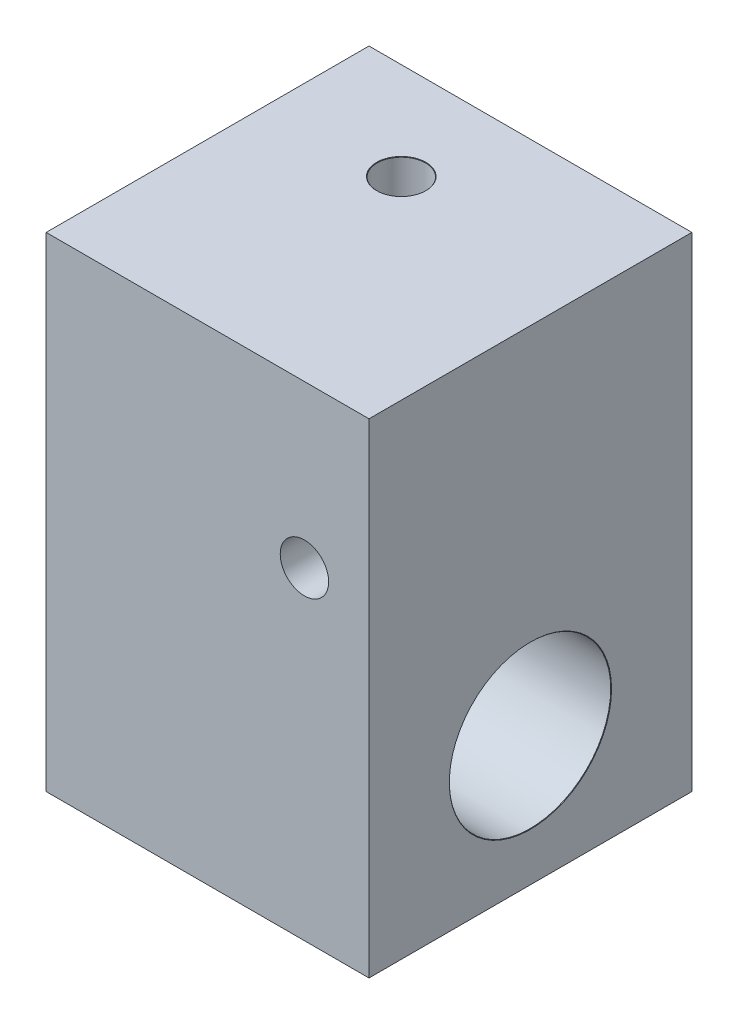
ISO-10303-21;
HEADER;
FILE_DESCRIPTION(('STEP AP214'),'2;1');
FILE_NAME('part.step','',(''),(''),'','','');
FILE_SCHEMA(('AUTOMOTIVE_DESIGN { 1 0 10303 214 1 1 1 1 }'));
ENDSEC;
DATA;
#1=APPLICATION_CONTEXT('core data for automotive mechanical design processes');
#2=APPLICATION_PROTOCOL_DEFINITION('international standard','automotive_design',2000,#1);
#3=PRODUCT_CONTEXT('',#1,'mechanical');
#4=PRODUCT('Part','Part','',(#3));
#5=PRODUCT_RELATED_PRODUCT_CATEGORY('part','',(#4));
#6=PRODUCT_DEFINITION_FORMATION('','',#4);
#7=PRODUCT_DEFINITION_CONTEXT('part definition',#1,'design');
#8=PRODUCT_DEFINITION('design','',#6,#7);
#9=PRODUCT_DEFINITION_SHAPE('','',#8);
#10=(LENGTH_UNIT() NAMED_UNIT(*) SI_UNIT(.MILLI.,.METRE.));
#11=(NAMED_UNIT(*) PLANE_ANGLE_UNIT() SI_UNIT($,.RADIAN.));
#12=(NAMED_UNIT(*) SI_UNIT($,.STERADIAN.) SOLID_ANGLE_UNIT());
#13=UNCERTAINTY_MEASURE_WITH_UNIT(LENGTH_MEASURE(1.E-05),#10,'distance_accuracy_value','');
#14=(GEOMETRIC_REPRESENTATION_CONTEXT(3) GLOBAL_UNCERTAINTY_ASSIGNED_CONTEXT((#13)) GLOBAL_UNIT_ASSIGNED_CONTEXT((#10,
#11,#12)) REPRESENTATION_CONTEXT('',''));
#15=CARTESIAN_POINT('',(0.,0.,0.));
#16=DIRECTION('',(0.,0.,1.));
#17=DIRECTION('',(1.,0.,0.));
#18=AXIS2_PLACEMENT_3D('',#15,#16,#17);
#19=CARTESIAN_POINT('',(0.,30.,-1.9004617207274));
#20=DIRECTION('',(1.,0.,0.));
#21=DIRECTION('',(0.,0.,-1.));
#22=AXIS2_PLACEMENT_3D('',#19,#20,#21);
#23=PLANE('',#22);
#24=CARTESIAN_POINT('',(0.,8.,8.0995382792726));
#25=DIRECTION('',(1.,0.,0.));
#26=DIRECTION('',(0.,0.,-1.));
#27=AXIS2_PLACEMENT_3D('',#24,#25,#26);
#28=CIRCLE('',#27,0.00716155294845132);
#29=CARTESIAN_POINT('',(0.,8.,8.09237672632415));
#30=VERTEX_POINT('',#29);
#31=EDGE_CURVE('E40',#30,#30,#28,.T.);
#32=ORIENTED_EDGE('',*,*,#31,.T.);
#33=EDGE_LOOP('',(#32));
#34=FACE_BOUND('',#33,.T.);
#35=CARTESIAN_POINT('',(0.,25.,8.0995382792726));
#36=DIRECTION('',(-1.,0.,0.));
#37=DIRECTION('',(0.,0.,1.));
#38=AXIS2_PLACEMENT_3D('',#35,#36,#37);
#39=CIRCLE('',#38,1.525);
#40=CARTESIAN_POINT('',(0.,25.,9.6245382792726));
#41=VERTEX_POINT('',#40);
#42=EDGE_CURVE('E104',#41,#41,#39,.T.);
#43=ORIENTED_EDGE('',*,*,#42,.F.);
#44=EDGE_LOOP('',(#43));
#45=FACE_BOUND('',#44,.T.);
#46=DIRECTION('',(0.,0.,1.));
#47=VECTOR('',#46,1.);
#48=CARTESIAN_POINT('',(0.,0.,-1.9004617207274));
#49=LINE('',#48,#47);
#50=CARTESIAN_POINT('',(0.,0.,-1.9004617207274));
#51=VERTEX_POINT('',#50);
#52=CARTESIAN_POINT('',(0.,0.,18.0995382792726));
#53=VERTEX_POINT('',#52);
#54=EDGE_CURVE('E129',#51,#53,#49,.T.);
#55=ORIENTED_EDGE('',*,*,#54,.T.);
#56=DIRECTION('',(0.,-1.,0.));
#57=VECTOR('',#56,1.);
#58=CARTESIAN_POINT('',(0.,30.,18.0995382792726));
#59=LINE('',#58,#57);
#60=CARTESIAN_POINT('',(0.,30.,18.0995382792726));
#61=VERTEX_POINT('',#60);
#62=EDGE_CURVE('E45',#61,#53,#59,.T.);
#63=ORIENTED_EDGE('',*,*,#62,.F.);
#64=DIRECTION('',(0.,0.,1.));
#65=VECTOR('',#64,1.);
#66=CARTESIAN_POINT('',(0.,30.,-1.9004617207274));
#67=LINE('',#66,#65);
#68=CARTESIAN_POINT('',(0.,30.,-1.9004617207274));
#69=VERTEX_POINT('',#68);
#70=EDGE_CURVE('E130',#69,#61,#67,.T.);
#71=ORIENTED_EDGE('',*,*,#70,.F.);
#72=DIRECTION('',(0.,-1.,0.));
#73=VECTOR('',#72,1.);
#74=CARTESIAN_POINT('',(0.,30.,-1.9004617207274));
#75=LINE('',#74,#73);
#76=EDGE_CURVE('E136',#69,#51,#75,.T.);
#77=ORIENTED_EDGE('',*,*,#76,.T.);
#78=EDGE_LOOP('',(#55,#63,#71,#77));
#79=FACE_BOUND('',#78,.T.);
#80=ADVANCED_FACE('F37',(#34,#45,#79),#23,.F.);
#81=CARTESIAN_POINT('',(0.,30.,18.0995382792726));
#82=DIRECTION('',(0.,0.,-1.));
#83=DIRECTION('',(-1.,0.,0.));
#84=AXIS2_PLACEMENT_3D('',#81,#82,#83);
#85=PLANE('',#84);
#86=CARTESIAN_POINT('',(16.,20.,18.0995382792726));
#87=DIRECTION('',(0.,0.,-1.));
#88=DIRECTION('',(-1.,0.,0.));
#89=AXIS2_PLACEMENT_3D('',#86,#87,#88);
#90=CIRCLE('',#89,1.5);
#91=CARTESIAN_POINT('',(14.5,20.,18.0995382792726));
#92=VERTEX_POINT('',#91);
#93=EDGE_CURVE('E126',#92,#92,#90,.T.);
#94=ORIENTED_EDGE('',*,*,#93,.T.);
#95=EDGE_LOOP('',(#94));
#96=FACE_BOUND('',#95,.T.);
#97=DIRECTION('',(1.,0.,0.));
#98=VECTOR('',#97,1.);
#99=CARTESIAN_POINT('',(0.,0.,18.0995382792726));
#100=LINE('',#99,#98);
#101=CARTESIAN_POINT('',(20.,0.,18.0995382792726));
#102=VERTEX_POINT('',#101);
#103=EDGE_CURVE('E139',#53,#102,#100,.T.);
#104=ORIENTED_EDGE('',*,*,#103,.T.);
#105=DIRECTION('',(0.,-1.,0.));
#106=VECTOR('',#105,1.);
#107=CARTESIAN_POINT('',(20.,30.,18.0995382792726));
#108=LINE('',#107,#106);
#109=CARTESIAN_POINT('',(20.,30.,18.0995382792726));
#110=VERTEX_POINT('',#109);
#111=EDGE_CURVE('E147',#110,#102,#108,.T.);
#112=ORIENTED_EDGE('',*,*,#111,.F.);
#113=DIRECTION('',(1.,0.,0.));
#114=VECTOR('',#113,1.);
#115=CARTESIAN_POINT('',(0.,30.,18.0995382792726));
#116=LINE('',#115,#114);
#117=EDGE_CURVE('E88',#61,#110,#116,.T.);
#118=ORIENTED_EDGE('',*,*,#117,.F.);
#119=ORIENTED_EDGE('',*,*,#62,.T.);
#120=EDGE_LOOP('',(#104,#112,#118,#119));
#121=FACE_BOUND('',#120,.T.);
#122=ADVANCED_FACE('F186',(#96,#121),#85,.F.);
#123=CARTESIAN_POINT('',(20.,30.,-1.9004617207274));
#124=DIRECTION('',(-1.,0.,0.));
#125=DIRECTION('',(0.,0.,1.));
#126=AXIS2_PLACEMENT_3D('',#123,#124,#125);
#127=PLANE('',#126);
#128=CARTESIAN_POINT('',(20.,8.,8.0995382792726));
#129=DIRECTION('',(1.,0.,0.));
#130=DIRECTION('',(0.,0.,-1.));
#131=AXIS2_PLACEMENT_3D('',#128,#129,#130);
#132=CIRCLE('',#131,5.025);
#133=CARTESIAN_POINT('',(20.,8.,3.07453827927259));
#134=VERTEX_POINT('',#133);
#135=EDGE_CURVE('E230',#134,#134,#132,.T.);
#136=ORIENTED_EDGE('',*,*,#135,.F.);
#137=EDGE_LOOP('',(#136));
#138=FACE_BOUND('',#137,.T.);
#139=DIRECTION('',(0.,0.,-1.));
#140=VECTOR('',#139,1.);
#141=CARTESIAN_POINT('',(20.,0.,-1.9004617207274));
#142=LINE('',#141,#140);
#143=CARTESIAN_POINT('',(20.,0.,-1.9004617207274));
#144=VERTEX_POINT('',#143);
#145=EDGE_CURVE('E141',#102,#144,#142,.T.);
#146=ORIENTED_EDGE('',*,*,#145,.T.);
#147=DIRECTION('',(0.,-1.,0.));
#148=VECTOR('',#147,1.);
#149=CARTESIAN_POINT('',(20.,30.,-1.9004617207274));
#150=LINE('',#149,#148);
#151=CARTESIAN_POINT('',(20.,30.,-1.9004617207274));
#152=VERTEX_POINT('',#151);
#153=EDGE_CURVE('E145',#152,#144,#150,.T.);
#154=ORIENTED_EDGE('',*,*,#153,.F.);
#155=DIRECTION('',(0.,0.,-1.));
#156=VECTOR('',#155,1.);
#157=CARTESIAN_POINT('',(20.,30.,-1.9004617207274));
#158=LINE('',#157,#156);
#159=EDGE_CURVE('E133',#110,#152,#158,.T.);
#160=ORIENTED_EDGE('',*,*,#159,.F.);
#161=ORIENTED_EDGE('',*,*,#111,.T.);
#162=EDGE_LOOP('',(#146,#154,#160,#161));
#163=FACE_BOUND('',#162,.T.);
#164=ADVANCED_FACE('F191',(#138,#163),#127,.F.);
#165=CARTESIAN_POINT('',(0.,30.,-1.9004617207274));
#166=DIRECTION('',(0.,0.,1.));
#167=DIRECTION('',(1.,0.,0.));
#168=AXIS2_PLACEMENT_3D('',#165,#166,#167);
#169=PLANE('',#168);
#170=CARTESIAN_POINT('',(16.,20.,-1.90046172072741));
#171=DIRECTION('',(0.,0.,-1.));
#172=DIRECTION('',(-1.,0.,0.));
#173=AXIS2_PLACEMENT_3D('',#170,#171,#172);
#174=CIRCLE('',#173,1.525);
#175=CARTESIAN_POINT('',(14.475,20.,-1.90046172072741));
#176=VERTEX_POINT('',#175);
#177=EDGE_CURVE('E120',#176,#176,#174,.T.);
#178=ORIENTED_EDGE('',*,*,#177,.F.);
#179=EDGE_LOOP('',(#178));
#180=FACE_BOUND('',#179,.T.);
#181=DIRECTION('',(-1.,0.,0.));
#182=VECTOR('',#181,1.);
#183=CARTESIAN_POINT('',(0.,0.,-1.9004617207274));
#184=LINE('',#183,#182);
#185=EDGE_CURVE('E80',#144,#51,#184,.T.);
#186=ORIENTED_EDGE('',*,*,#185,.T.);
#187=ORIENTED_EDGE('',*,*,#76,.F.);
#188=DIRECTION('',(-1.,0.,0.));
#189=VECTOR('',#188,1.);
#190=CARTESIAN_POINT('',(0.,30.,-1.9004617207274));
#191=LINE('',#190,#189);
#192=EDGE_CURVE('E59',#152,#69,#191,.T.);
#193=ORIENTED_EDGE('',*,*,#192,.F.);
#194=ORIENTED_EDGE('',*,*,#153,.T.);
#195=EDGE_LOOP('',(#186,#187,#193,#194));
#196=FACE_BOUND('',#195,.T.);
#197=ADVANCED_FACE('F209',(#180,#196),#169,.F.);
#198=CARTESIAN_POINT('',(0.,30.,0.));
#199=DIRECTION('',(0.,1.,0.));
#200=DIRECTION('',(0.,0.,1.));
#201=AXIS2_PLACEMENT_3D('',#198,#199,#200);
#202=PLANE('',#201);
#203=CARTESIAN_POINT('',(8.,30.,4.0995382792726));
#204=DIRECTION('',(0.,1.,0.));
#205=DIRECTION('',(0.,0.,1.));
#206=AXIS2_PLACEMENT_3D('',#203,#204,#205);
#207=CIRCLE('',#206,1.525);
#208=CARTESIAN_POINT('',(8.,30.,5.6245382792726));
#209=VERTEX_POINT('',#208);
#210=EDGE_CURVE('E111',#209,#209,#207,.T.);
#211=ORIENTED_EDGE('',*,*,#210,.F.);
#212=EDGE_LOOP('',(#211));
#213=FACE_BOUND('',#212,.T.);
#214=ORIENTED_EDGE('',*,*,#70,.T.);
#215=ORIENTED_EDGE('',*,*,#117,.T.);
#216=ORIENTED_EDGE('',*,*,#159,.T.);
#217=ORIENTED_EDGE('',*,*,#192,.T.);
#218=EDGE_LOOP('',(#214,#215,#216,#217));
#219=FACE_BOUND('',#218,.T.);
#220=ADVANCED_FACE('F207',(#213,#219),#202,.T.);
#221=CARTESIAN_POINT('',(0.,0.,0.));
#222=DIRECTION('',(0.,1.,0.));
#223=DIRECTION('',(0.,0.,1.));
#224=AXIS2_PLACEMENT_3D('',#221,#222,#223);
#225=PLANE('',#224);
#226=ORIENTED_EDGE('',*,*,#54,.F.);
#227=ORIENTED_EDGE('',*,*,#185,.F.);
#228=ORIENTED_EDGE('',*,*,#145,.F.);
#229=ORIENTED_EDGE('',*,*,#103,.F.);
#230=EDGE_LOOP('',(#226,#227,#228,#229));
#231=FACE_BOUND('',#230,.T.);
#232=ADVANCED_FACE('F202',(#231),#225,.F.);
#233=CARTESIAN_POINT('',(16.,20.,-1.9004617207274));
#234=DIRECTION('',(0.,0.,-1.));
#235=DIRECTION('',(-1.,0.,0.));
#236=AXIS2_PLACEMENT_3D('',#233,#234,#235);
#237=CYLINDRICAL_SURFACE('',#236,1.5);
#238=ORIENTED_EDGE('',*,*,#93,.F.);
#239=EDGE_LOOP('',(#238));
#240=FACE_BOUND('',#239,.T.);
#241=CARTESIAN_POINT('',(16.,20.,-1.8754617207274));
#242=DIRECTION('',(0.,0.,-1.));
#243=DIRECTION('',(-1.,0.,0.));
#244=AXIS2_PLACEMENT_3D('',#241,#242,#243);
#245=CIRCLE('',#244,1.5);
#246=CARTESIAN_POINT('',(14.5,20.,-1.8754617207274));
#247=VERTEX_POINT('',#246);
#248=EDGE_CURVE('E123',#247,#247,#245,.T.);
#249=ORIENTED_EDGE('',*,*,#248,.T.);
#250=EDGE_LOOP('',(#249));
#251=FACE_BOUND('',#250,.T.);
#252=ADVANCED_FACE('F216',(#240,#251),#237,.F.);
#253=CARTESIAN_POINT('',(16.,20.,-1.90046172072741));
#254=DIRECTION('',(0.,0.,-1.));
#255=DIRECTION('',(-1.,0.,0.));
#256=AXIS2_PLACEMENT_3D('',#253,#254,#255);
#257=CONICAL_SURFACE('',#256,1.525,0.785398163397357);
#258=ORIENTED_EDGE('',*,*,#248,.F.);
#259=EDGE_LOOP('',(#258));
#260=FACE_BOUND('',#259,.T.);
#261=ORIENTED_EDGE('',*,*,#177,.T.);
#262=EDGE_LOOP('',(#261));
#263=FACE_BOUND('',#262,.T.);
#264=ADVANCED_FACE('F314',(#260,#263),#257,.F.);
#265=CARTESIAN_POINT('',(12.,25.,8.0995382792726));
#266=DIRECTION('',(-1.,0.,0.));
#267=DIRECTION('',(0.,0.,1.));
#268=AXIS2_PLACEMENT_3D('',#265,#266,#267);
#269=CONICAL_SURFACE('',#268,1.5,1.02974425867665);
#270=CARTESIAN_POINT('',(12.9012909285413,25.,8.0995382792726));
#271=VERTEX_POINT('',#270);
#272=VERTEX_LOOP('',#271);
#273=FACE_BOUND('',#272,.T.);
#274=CARTESIAN_POINT('',(12.,25.,8.0995382792726));
#275=DIRECTION('',(-1.,0.,0.));
#276=DIRECTION('',(0.,0.,1.));
#277=AXIS2_PLACEMENT_3D('',#274,#275,#276);
#278=CIRCLE('',#277,1.5);
#279=CARTESIAN_POINT('',(12.,25.,9.59953827927259));
#280=VERTEX_POINT('',#279);
#281=EDGE_CURVE('E117',#280,#280,#278,.T.);
#282=ORIENTED_EDGE('',*,*,#281,.T.);
#283=EDGE_LOOP('',(#282));
#284=FACE_BOUND('',#283,.T.);
#285=ADVANCED_FACE('F304',(#273,#284),#269,.F.);
#286=CARTESIAN_POINT('',(0.,25.,8.0995382792726));
#287=DIRECTION('',(-1.,0.,0.));
#288=DIRECTION('',(0.,0.,1.));
#289=AXIS2_PLACEMENT_3D('',#286,#287,#288);
#290=CYLINDRICAL_SURFACE('',#289,1.49999999999999);
#291=ORIENTED_EDGE('',*,*,#281,.F.);
#292=EDGE_LOOP('',(#291));
#293=FACE_BOUND('',#292,.T.);
#294=CARTESIAN_POINT('',(0.0250000000000121,25.,8.0995382792726));
#295=DIRECTION('',(-1.,0.,0.));
#296=DIRECTION('',(0.,0.,1.));
#297=AXIS2_PLACEMENT_3D('',#294,#295,#296);
#298=CIRCLE('',#297,1.49999999999999);
#299=CARTESIAN_POINT('',(0.0250000000000123,25.,9.59953827927258));
#300=VERTEX_POINT('',#299);
#301=EDGE_CURVE('E108',#300,#300,#298,.T.);
#302=ORIENTED_EDGE('',*,*,#301,.T.);
#303=EDGE_LOOP('',(#302));
#304=FACE_BOUND('',#303,.T.);
#305=ADVANCED_FACE('F295',(#293,#304),#290,.F.);
#306=CARTESIAN_POINT('',(0.,25.,8.0995382792726));
#307=DIRECTION('',(-1.,0.,0.));
#308=DIRECTION('',(0.,0.,1.));
#309=AXIS2_PLACEMENT_3D('',#306,#307,#308);
#310=CONICAL_SURFACE('',#309,1.525,0.785398163397414);
#311=ORIENTED_EDGE('',*,*,#301,.F.);
#312=EDGE_LOOP('',(#311));
#313=FACE_BOUND('',#312,.T.);
#314=ORIENTED_EDGE('',*,*,#42,.T.);
#315=EDGE_LOOP('',(#314));
#316=FACE_BOUND('',#315,.T.);
#317=ADVANCED_FACE('F268',(#313,#316),#310,.F.);
#318=CARTESIAN_POINT('',(8.,10.,4.0995382792726));
#319=DIRECTION('',(0.,1.,0.));
#320=DIRECTION('',(0.,0.,1.));
#321=AXIS2_PLACEMENT_3D('',#318,#319,#320);
#322=CONICAL_SURFACE('',#321,1.49999999999999,1.02974425867665);
#323=CARTESIAN_POINT('',(8.,10.,4.0995382792726));
#324=DIRECTION('',(0.,1.,0.));
#325=DIRECTION('',(0.,0.,1.));
#326=AXIS2_PLACEMENT_3D('',#323,#324,#325);
#327=CIRCLE('',#326,1.49999999999999);
#328=CARTESIAN_POINT('',(9.38224656253748,10.,3.51696258431676));
#329=VERTEX_POINT('',#328);
#330=CARTESIAN_POINT('',(6.61775343746252,10.,3.51696258431676));
#331=VERTEX_POINT('',#330);
#332=EDGE_CURVE('E100',#329,#331,#327,.T.);
#333=ORIENTED_EDGE('',*,*,#332,.T.);
#334=CARTESIAN_POINT('',(6.44123645028541,10.0903290928541,3.55745458524322));
#335=CARTESIAN_POINT('',(6.47638702361608,10.0720429405464,3.54903882483175));
#336=CARTESIAN_POINT('',(6.51163876865664,10.0538669079315,3.54080807996175));
#337=CARTESIAN_POINT('',(6.58236772703157,10.0177858987624,3.52472352478772));
#338=CARTESIAN_POINT('',(6.61784494798864,9.99988093144204,3.51686972730482));
#339=CARTESIAN_POINT('',(6.72478174543633,9.94658301792164,3.49385572054587));
#340=CARTESIAN_POINT('',(6.79661251243338,9.91167722384374,3.47927506399216));
#341=CARTESIAN_POINT('',(6.94495589717175,9.84219689922331,3.45112133170947));
#342=CARTESIAN_POINT('',(7.02152861602041,9.80771723126283,3.43762925721693));
#343=CARTESIAN_POINT('',(7.17642553254067,9.74215666224481,3.41273640883918));
#344=CARTESIAN_POINT('',(7.25474836588889,9.71107321780461,3.40133406558906));
#345=CARTESIAN_POINT('',(7.38116547775162,9.6661010776519,3.38525934407128));
#346=CARTESIAN_POINT('',(7.42849634106478,9.65038548044021,3.37974372502932));
#347=CARTESIAN_POINT('',(7.52405997696393,9.62160673917025,3.36977903888754));
#348=CARTESIAN_POINT('',(7.5722923071465,9.60854232950347,3.36532946270227));
#349=CARTESIAN_POINT('',(7.66883665700479,9.58609091994483,3.35776068805869));
#350=CARTESIAN_POINT('',(7.71713259177767,9.57664371377543,3.3546196244471));
#351=CARTESIAN_POINT('',(7.81443289620939,9.56194994906261,3.34976210905704));
#352=CARTESIAN_POINT('',(7.86343697813677,9.55670173069128,3.34804509435304));
#353=CARTESIAN_POINT('',(7.96239580021981,9.55096468892006,3.3461690529115));
#354=CARTESIAN_POINT('',(8.01235467476216,9.5505377293244,3.346030277128));
#355=CARTESIAN_POINT('',(8.11204309695725,9.55466018728013,3.34737713619428));
#356=CARTESIAN_POINT('',(8.16177260777769,9.55921037793576,3.34886302340409));
#357=CARTESIAN_POINT('',(8.26145363040456,9.57286406381851,3.35336618209512));
#358=CARTESIAN_POINT('',(8.31139207697459,9.58205064948085,3.35641141422722));
#359=CARTESIAN_POINT('',(8.41033640760895,9.60411631276034,3.36382871212606));
#360=CARTESIAN_POINT('',(8.45934200985356,9.61699648793708,3.36820117230464));
#361=CARTESIAN_POINT('',(8.55538706879129,9.64525946409422,3.37795593177209));
#362=CARTESIAN_POINT('',(8.60244621647877,9.6605845135811,3.38331528591629));
#363=CARTESIAN_POINT('',(8.69575461266634,9.69324476912792,3.39494235146468));
#364=CARTESIAN_POINT('',(8.74200360191829,9.7105806055808,3.40121034788799));
#365=CARTESIAN_POINT('',(8.83386441838471,9.74677429624331,3.41454605818499));
#366=CARTESIAN_POINT('',(8.87947513754158,9.76563448549195,3.42161500589463));
#367=CARTESIAN_POINT('',(8.97009828926242,9.80448379472837,3.43646291937563));
#368=CARTESIAN_POINT('',(9.01511065460828,9.82447304025043,3.44424196415871));
#369=CARTESIAN_POINT('',(9.14475071973116,9.88359569682011,3.46771405695268));
#370=CARTESIAN_POINT('',(9.22872441522546,9.92382943539441,3.48425104611692));
#371=CARTESIAN_POINT('',(9.35345321355006,9.98547610502822,3.5105967030124));
#372=CARTESIAN_POINT('',(9.39472989189421,10.0061914817338,3.51961260888526));
#373=CARTESIAN_POINT('',(9.47697073009595,10.0479980549236,3.53815402131795));
#374=CARTESIAN_POINT('',(9.51793492862447,10.0690892037901,3.5476794636115));
#375=CARTESIAN_POINT('',(9.55876354971459,10.0903290928541,3.55745458524315));
#376=B_SPLINE_CURVE_WITH_KNOTS('',3,(#334,#335,#336,#337,#338,#339,#340,#341,#342,#343,#344,
#345,#346,#347,#348,#349,#350,#351,#352,#353,#354,#355,#356,#357,#358,#359,#360,#361,#362,#363,
#364,#365,#366,#367,#368,#369,#370,#371,#372,#373,#374,#375),.UNSPECIFIED.,.F.,.F.,(4,2,2,2,2,2,
2,2,2,2,2,2,2,2,2,2,2,2,2,2,4),(0.,0.121517600913621,0.243039332084113,0.486546431611187,
0.741644887927715,0.996550976024085,1.14701268358301,1.29740239476079,1.4451671695246,
1.59287350509923,1.74247300742259,1.89209575044202,2.04450056026567,2.19695070458047,
2.34622364546585,2.49554351138879,2.64509660924532,2.79466636804234,3.0782968808009,
3.21945898738441,3.36060333141117),.UNSPECIFIED.);
#377=EDGE_CURVE('E11',#331,#329,#376,.T.);
#378=ORIENTED_EDGE('',*,*,#377,.T.);
#379=EDGE_LOOP('',(#333,#378));
#380=FACE_BOUND('',#379,.T.);
#381=ADVANCED_FACE('F103',(#380),#322,.F.);
#382=CARTESIAN_POINT('',(8.,30.,4.0995382792726));
#383=DIRECTION('',(0.,1.,0.));
#384=DIRECTION('',(0.,0.,1.));
#385=AXIS2_PLACEMENT_3D('',#382,#383,#384);
#386=CYLINDRICAL_SURFACE('',#385,1.49999999999999);
#387=ORIENTED_EDGE('',*,*,#332,.F.);
#388=CARTESIAN_POINT('',(9.38224656253749,10.,3.51696258431676));
#389=CARTESIAN_POINT('',(9.40272047788601,10.1114743482228,3.56560865951727));
#390=CARTESIAN_POINT('',(9.42199212450891,10.2214568986314,3.61845711603745));
#391=CARTESIAN_POINT('',(9.45569548491361,10.4384652182196,3.73273120455118));
#392=CARTESIAN_POINT('',(9.47009806174932,10.5454697890159,3.79420546171662));
#393=CARTESIAN_POINT('',(9.49149545281046,10.7568878254345,3.9263684416665));
#394=CARTESIAN_POINT('',(9.4983690439718,10.8612331941248,3.99718794714836));
#395=CARTESIAN_POINT('',(9.50111888288063,11.0641434611483,4.14646113903656));
#396=CARTESIAN_POINT('',(9.49702643349112,11.1627239939736,4.22489248086523));
#397=CARTESIAN_POINT('',(9.47559884495974,11.3417424534158,4.37865048725254));
#398=CARTESIAN_POINT('',(9.45985871135463,11.4229571546482,4.45327789158043));
#399=CARTESIAN_POINT('',(9.41436019424427,11.5780643718663,4.60537166200209));
#400=CARTESIAN_POINT('',(9.38465311000718,11.6519824951603,4.68282669010499));
#401=CARTESIAN_POINT('',(9.30805190980846,11.7919868504237,4.838876065046));
#402=CARTESIAN_POINT('',(9.26092834724774,11.8579521766289,4.91747150937529));
#403=CARTESIAN_POINT('',(9.17626493721971,11.948399306578,5.03155261860306));
#404=CARTESIAN_POINT('',(9.14571414891291,11.9771315230015,5.06894428749397));
#405=CARTESIAN_POINT('',(9.07991883205923,12.0315596771523,5.14173805640659));
#406=CARTESIAN_POINT('',(9.04467643056073,12.0572569809204,5.17714104775774));
#407=CARTESIAN_POINT('',(8.95409683218655,12.1153267164945,5.25919586691597));
#408=CARTESIAN_POINT('',(8.89645648308377,12.1460975376081,5.3044853763294));
#409=CARTESIAN_POINT('',(8.77288633768327,12.200702749519,5.3872392817129));
#410=CARTESIAN_POINT('',(8.70696015001725,12.2245401450593,5.42470706539609));
#411=CARTESIAN_POINT('',(8.56812378459614,12.2651294256811,5.48991014025968));
#412=CARTESIAN_POINT('',(8.49519083623824,12.2818571804065,5.51761223296058));
#413=CARTESIAN_POINT('',(8.34468517655983,12.3080188534151,5.56150048573387));
#414=CARTESIAN_POINT('',(8.26711299347749,12.3174536004064,5.5776879542023));
#415=CARTESIAN_POINT('',(8.11471729319815,12.3286705056178,5.59699424388842));
#416=CARTESIAN_POINT('',(8.04001910802131,12.3308885460719,5.60085715316018));
#417=CARTESIAN_POINT('',(7.89097435720005,12.3289071689672,5.5974256502569));
#418=CARTESIAN_POINT('',(7.81662772434895,12.3247090322327,5.59013346490852));
#419=CARTESIAN_POINT('',(7.67186477769903,12.3100342288961,5.56501515139864));
#420=CARTESIAN_POINT('',(7.60140052925537,12.2996789426034,5.54739276235658));
#421=CARTESIAN_POINT('',(7.46481078493203,12.2728064541796,5.50265533063686));
#422=CARTESIAN_POINT('',(7.39868514535618,12.2562894562476,5.47554060253728));
#423=CARTESIAN_POINT('',(7.27107348845815,12.2167716094418,5.41248743017811));
#424=CARTESIAN_POINT('',(7.20971137265014,12.1936439942567,5.37637844738413));
#425=CARTESIAN_POINT('',(7.09443499967231,12.1412781303886,5.29738606652725));
#426=CARTESIAN_POINT('',(7.04052213925085,12.1120387383124,5.25450140123444));
#427=CARTESIAN_POINT('',(6.93735988789654,12.0455598889783,5.16066660066704));
#428=CARTESIAN_POINT('',(6.88870500521939,12.0079024596653,5.10936136547492));
#429=CARTESIAN_POINT('',(6.80095127532151,11.9266521319734,5.00343197185677));
#430=CARTESIAN_POINT('',(6.76185748380787,11.8830561122786,4.94880607651264));
#431=CARTESIAN_POINT('',(6.6778261937273,11.77048827573,4.81410655811894));
#432=CARTESIAN_POINT('',(6.63776040322011,11.698734671026,4.73331246173402));
#433=CARTESIAN_POINT('',(6.57418637073594,11.5465884973973,4.57335578001326));
#434=CARTESIAN_POINT('',(6.5507099559022,11.4661796617535,4.49419661211823));
#435=CARTESIAN_POINT('',(6.52195239674284,11.3217424121734,4.36151076703615));
#436=CARTESIAN_POINT('',(6.51344439915918,11.2592827144516,4.30691669091823));
#437=CARTESIAN_POINT('',(6.50245907165531,11.1313916965124,4.20065282536179));
#438=CARTESIAN_POINT('',(6.49998484991729,11.065958862412,4.14898455647566));
#439=CARTESIAN_POINT('',(6.50003066413146,10.8656168826377,3.99879708587582));
#440=CARTESIAN_POINT('',(6.51005596777677,10.7268920871682,3.90530473246499));
#441=CARTESIAN_POINT('',(6.53729057199697,10.489743590308,3.76208273530776));
#442=CARTESIAN_POINT('',(6.55098602099679,10.3933198768711,3.70816061885727));
#443=CARTESIAN_POINT('',(6.58206159464755,10.198336295413,3.60740903357972));
#444=CARTESIAN_POINT('',(6.59941313892525,10.099798033659,3.56052912058713));
#445=CARTESIAN_POINT('',(6.61775343746252,10.,3.51696258431676));
#446=B_SPLINE_CURVE_WITH_KNOTS('',3,(#388,#389,#390,#391,#392,#393,#394,#395,#396,#397,#398,
#399,#400,#401,#402,#403,#404,#405,#406,#407,#408,#409,#410,#411,#412,#413,#414,#415,#416,#417,
#418,#419,#420,#421,#422,#423,#424,#425,#426,#427,#428,#429,#430,#431,#432,#433,#434,#435,#436,
#437,#438,#439,#440,#441,#442,#443,#444,#445),.UNSPECIFIED.,.F.,.F.,(4,2,2,2,2,2,2,2,2,2,2,2,2,
2,2,2,2,2,2,2,2,2,2,2,2,2,2,2,4),(0.,0.370098527977467,0.74237409983135,1.12055931721438,
1.49766614539376,1.83092800200713,2.16297526951453,2.49956266151583,2.66785612379618,
2.83607354465994,3.07347806191355,3.31077954120262,3.54888011953901,3.78695363840485,
4.01035142930697,4.23370463042684,4.45279425290378,4.67187661539286,4.89547993266523,
5.11912511921939,5.35849665630114,5.59799449575025,5.94181150870309,6.28628636559557,
6.53612456042797,6.78609142738351,7.28694919548692,7.62066433002786,7.95186159637462),.UNSPECIFIED.);
#447=EDGE_CURVE('E51',#329,#331,#446,.T.);
#448=ORIENTED_EDGE('',*,*,#447,.T.);
#449=EDGE_LOOP('',(#387,#448));
#450=FACE_BOUND('',#449,.T.);
#451=CARTESIAN_POINT('',(8.,29.975,4.0995382792726));
#452=DIRECTION('',(0.,1.,0.));
#453=DIRECTION('',(0.,0.,1.));
#454=AXIS2_PLACEMENT_3D('',#451,#452,#453);
#455=CIRCLE('',#454,1.49999999999999);
#456=CARTESIAN_POINT('',(8.,29.975,5.59953827927259));
#457=VERTEX_POINT('',#456);
#458=EDGE_CURVE('E105',#457,#457,#455,.T.);
#459=ORIENTED_EDGE('',*,*,#458,.T.);
#460=EDGE_LOOP('',(#459));
#461=FACE_BOUND('',#460,.T.);
#462=ADVANCED_FACE('F98',(#450,#461),#386,.F.);
#463=CARTESIAN_POINT('',(8.,30.,4.0995382792726));
#464=DIRECTION('',(0.,1.,0.));
#465=DIRECTION('',(0.,0.,1.));
#466=AXIS2_PLACEMENT_3D('',#463,#464,#465);
#467=CONICAL_SURFACE('',#466,1.525,0.785398163397379);
#468=ORIENTED_EDGE('',*,*,#458,.F.);
#469=EDGE_LOOP('',(#468));
#470=FACE_BOUND('',#469,.T.);
#471=ORIENTED_EDGE('',*,*,#210,.T.);
#472=EDGE_LOOP('',(#471));
#473=FACE_BOUND('',#472,.T.);
#474=ADVANCED_FACE('F176',(#470,#473),#467,.F.);
#475=CARTESIAN_POINT('',(3.,8.,8.0995382792726));
#476=DIRECTION('',(1.,0.,0.));
#477=DIRECTION('',(0.,0.,-1.));
#478=AXIS2_PLACEMENT_3D('',#475,#476,#477);
#479=CONICAL_SURFACE('',#478,5.,1.02974425867665);
#480=CARTESIAN_POINT('',(3.,8.,8.0995382792726));
#481=DIRECTION('',(1.,0.,0.));
#482=DIRECTION('',(0.,0.,-1.));
#483=AXIS2_PLACEMENT_3D('',#480,#481,#482);
#484=CIRCLE('',#483,5.);
#485=CARTESIAN_POINT('',(3.,8.,3.0995382792726));
#486=VERTEX_POINT('',#485);
#487=EDGE_CURVE('E101',#486,#486,#484,.T.);
#488=ORIENTED_EDGE('',*,*,#487,.T.);
#489=EDGE_LOOP('',(#488));
#490=FACE_BOUND('',#489,.T.);
#491=ORIENTED_EDGE('',*,*,#31,.F.);
#492=EDGE_LOOP('',(#491));
#493=FACE_BOUND('',#492,.T.);
#494=ADVANCED_FACE('F164',(#490,#493),#479,.F.);
#495=CARTESIAN_POINT('',(20.,8.,8.0995382792726));
#496=DIRECTION('',(1.,0.,0.));
#497=DIRECTION('',(0.,0.,-1.));
#498=AXIS2_PLACEMENT_3D('',#495,#496,#497);
#499=CYLINDRICAL_SURFACE('',#498,5.);
#500=ORIENTED_EDGE('',*,*,#487,.F.);
#501=EDGE_LOOP('',(#500));
#502=FACE_BOUND('',#501,.T.);
#503=CARTESIAN_POINT('',(19.975,8.,8.0995382792726));
#504=DIRECTION('',(1.,0.,0.));
#505=DIRECTION('',(0.,0.,-1.));
#506=AXIS2_PLACEMENT_3D('',#503,#504,#505);
#507=CIRCLE('',#506,5.);
#508=CARTESIAN_POINT('',(19.975,8.,3.0995382792726));
#509=VERTEX_POINT('',#508);
#510=EDGE_CURVE('E232',#509,#509,#507,.T.);
#511=ORIENTED_EDGE('',*,*,#510,.T.);
#512=EDGE_LOOP('',(#511));
#513=FACE_BOUND('',#512,.T.);
#514=ORIENTED_EDGE('',*,*,#377,.F.);
#515=ORIENTED_EDGE('',*,*,#447,.F.);
#516=EDGE_LOOP('',(#514,#515));
#517=FACE_BOUND('',#516,.T.);
#518=ADVANCED_FACE('F93',(#502,#513,#517),#499,.F.);
#519=CARTESIAN_POINT('',(20.,8.,8.0995382792726));
#520=DIRECTION('',(1.,0.,0.));
#521=DIRECTION('',(0.,0.,-1.));
#522=AXIS2_PLACEMENT_3D('',#519,#520,#521);
#523=CONICAL_SURFACE('',#522,5.025,0.785398163397587);
#524=ORIENTED_EDGE('',*,*,#510,.F.);
#525=EDGE_LOOP('',(#524));
#526=FACE_BOUND('',#525,.T.);
#527=ORIENTED_EDGE('',*,*,#135,.T.);
#528=EDGE_LOOP('',(#527));
#529=FACE_BOUND('',#528,.T.);
#530=ADVANCED_FACE('F163',(#526,#529),#523,.F.);
#531=CLOSED_SHELL('',(#80,#122,#164,#197,#220,#232,#252,#264,#285,#305,#317,#381,#462,#474,#494,
#518,#530));
#532=MANIFOLD_SOLID_BREP('B2',#531);
#533=ADVANCED_BREP_SHAPE_REPRESENTATION('',(#18,#532),#14);
#534=SHAPE_DEFINITION_REPRESENTATION(#9,#533);
ENDSEC;
END-ISO-10303-21;
